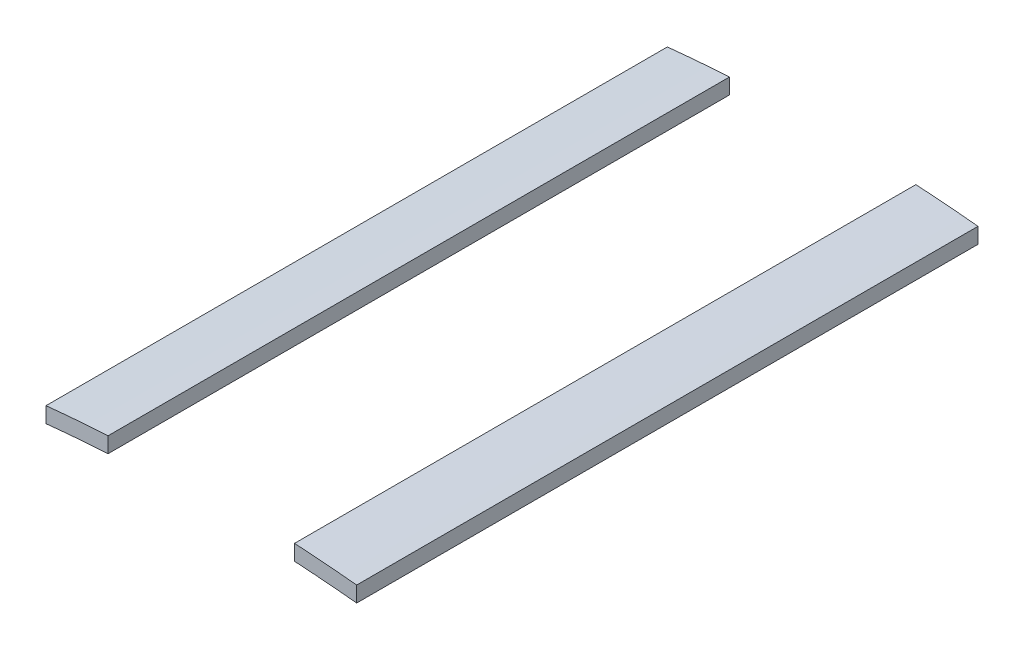
ISO-10303-21;
HEADER;
FILE_DESCRIPTION(('STEP AP214'),'2;1');
FILE_NAME('part.step','',(''),(''),'','','');
FILE_SCHEMA(('AUTOMOTIVE_DESIGN { 1 0 10303 214 1 1 1 1 }'));
ENDSEC;
DATA;
#1=APPLICATION_CONTEXT('core data for automotive mechanical design processes');
#2=APPLICATION_PROTOCOL_DEFINITION('international standard','automotive_design',2000,#1);
#3=PRODUCT_CONTEXT('',#1,'mechanical');
#4=PRODUCT('Part','Part','',(#3));
#5=PRODUCT_RELATED_PRODUCT_CATEGORY('part','',(#4));
#6=PRODUCT_DEFINITION_FORMATION('','',#4);
#7=PRODUCT_DEFINITION_CONTEXT('part definition',#1,'design');
#8=PRODUCT_DEFINITION('design','',#6,#7);
#9=PRODUCT_DEFINITION_SHAPE('','',#8);
#10=(LENGTH_UNIT() NAMED_UNIT(*) SI_UNIT(.MILLI.,.METRE.));
#11=(NAMED_UNIT(*) PLANE_ANGLE_UNIT() SI_UNIT($,.RADIAN.));
#12=(NAMED_UNIT(*) SI_UNIT($,.STERADIAN.) SOLID_ANGLE_UNIT());
#13=UNCERTAINTY_MEASURE_WITH_UNIT(LENGTH_MEASURE(1.E-05),#10,'distance_accuracy_value','');
#14=(GEOMETRIC_REPRESENTATION_CONTEXT(3) GLOBAL_UNCERTAINTY_ASSIGNED_CONTEXT((#13)) GLOBAL_UNIT_ASSIGNED_CONTEXT((#10,
#11,#12)) REPRESENTATION_CONTEXT('',''));
#15=CARTESIAN_POINT('',(0.,0.,0.));
#16=DIRECTION('',(0.,0.,1.));
#17=DIRECTION('',(1.,0.,0.));
#18=AXIS2_PLACEMENT_3D('',#15,#16,#17);
#19=CARTESIAN_POINT('',(0.,0.,20.));
#20=DIRECTION('',(0.,0.,-1.));
#21=DIRECTION('',(-1.,0.,0.));
#22=AXIS2_PLACEMENT_3D('',#19,#20,#21);
#23=CYLINDRICAL_SURFACE('',#22,49.5);
#24=CARTESIAN_POINT('',(0.,0.,0.));
#25=DIRECTION('',(0.,0.,1.));
#26=DIRECTION('',(1.,0.,0.));
#27=AXIS2_PLACEMENT_3D('',#24,#25,#26);
#28=CIRCLE('',#27,49.5);
#29=CARTESIAN_POINT('',(5.,49.246827308975,0.));
#30=VERTEX_POINT('',#29);
#31=CARTESIAN_POINT('',(3.,49.4090072760018,0.));
#32=VERTEX_POINT('',#31);
#33=EDGE_CURVE('E106',#30,#32,#28,.T.);
#34=ORIENTED_EDGE('',*,*,#33,.T.);
#35=DIRECTION('',(0.,0.,-1.));
#36=VECTOR('',#35,1.);
#37=CARTESIAN_POINT('',(3.,49.4090072760018,20.));
#38=LINE('',#37,#36);
#39=CARTESIAN_POINT('',(3.,49.4090072760018,20.));
#40=VERTEX_POINT('',#39);
#41=EDGE_CURVE('E12',#40,#32,#38,.T.);
#42=ORIENTED_EDGE('',*,*,#41,.F.);
#43=CARTESIAN_POINT('',(0.,0.,20.));
#44=DIRECTION('',(0.,0.,1.));
#45=DIRECTION('',(1.,0.,0.));
#46=AXIS2_PLACEMENT_3D('',#43,#44,#45);
#47=CIRCLE('',#46,49.5);
#48=CARTESIAN_POINT('',(5.,49.246827308975,20.));
#49=VERTEX_POINT('',#48);
#50=EDGE_CURVE('E94',#49,#40,#47,.T.);
#51=ORIENTED_EDGE('',*,*,#50,.F.);
#52=DIRECTION('',(0.,0.,-1.));
#53=VECTOR('',#52,1.);
#54=CARTESIAN_POINT('',(5.,49.246827308975,20.));
#55=LINE('',#54,#53);
#56=EDGE_CURVE('E102',#49,#30,#55,.T.);
#57=ORIENTED_EDGE('',*,*,#56,.T.);
#58=EDGE_LOOP('',(#34,#42,#51,#57));
#59=FACE_BOUND('',#58,.T.);
#60=ADVANCED_FACE('F43',(#59),#23,.T.);
#61=CARTESIAN_POINT('',(3.,49.4090072760018,20.));
#62=DIRECTION('',(1.,0.,0.));
#63=DIRECTION('',(0.,0.,-1.));
#64=AXIS2_PLACEMENT_3D('',#61,#62,#63);
#65=PLANE('',#64);
#66=DIRECTION('',(0.,-1.,0.));
#67=VECTOR('',#66,1.);
#68=CARTESIAN_POINT('',(3.,49.4090072760018,0.));
#69=LINE('',#68,#67);
#70=CARTESIAN_POINT('',(3.,48.9080770425499,0.));
#71=VERTEX_POINT('',#70);
#72=EDGE_CURVE('E98',#32,#71,#69,.T.);
#73=ORIENTED_EDGE('',*,*,#72,.T.);
#74=DIRECTION('',(0.,0.,-1.));
#75=VECTOR('',#74,1.);
#76=CARTESIAN_POINT('',(3.,48.9080770425499,20.));
#77=LINE('',#76,#75);
#78=CARTESIAN_POINT('',(3.,48.9080770425499,20.));
#79=VERTEX_POINT('',#78);
#80=EDGE_CURVE('E51',#79,#71,#77,.T.);
#81=ORIENTED_EDGE('',*,*,#80,.F.);
#82=DIRECTION('',(0.,-1.,0.));
#83=VECTOR('',#82,1.);
#84=CARTESIAN_POINT('',(3.,49.4090072760018,20.));
#85=LINE('',#84,#83);
#86=EDGE_CURVE('E89',#40,#79,#85,.T.);
#87=ORIENTED_EDGE('',*,*,#86,.F.);
#88=ORIENTED_EDGE('',*,*,#41,.T.);
#89=EDGE_LOOP('',(#73,#81,#87,#88));
#90=FACE_BOUND('',#89,.T.);
#91=ADVANCED_FACE('F97',(#90),#65,.F.);
#92=CARTESIAN_POINT('',(0.,0.,20.));
#93=DIRECTION('',(0.,0.,-1.));
#94=DIRECTION('',(-1.,0.,0.));
#95=AXIS2_PLACEMENT_3D('',#92,#93,#94);
#96=CYLINDRICAL_SURFACE('',#95,49.);
#97=CARTESIAN_POINT('',(0.,0.,0.));
#98=DIRECTION('',(0.,0.,-1.));
#99=DIRECTION('',(1.,0.,0.));
#100=AXIS2_PLACEMENT_3D('',#97,#98,#99);
#101=CIRCLE('',#100,49.);
#102=CARTESIAN_POINT('',(5.,48.7442304278158,0.));
#103=VERTEX_POINT('',#102);
#104=EDGE_CURVE('E76',#71,#103,#101,.T.);
#105=ORIENTED_EDGE('',*,*,#104,.T.);
#106=DIRECTION('',(0.,0.,-1.));
#107=VECTOR('',#106,1.);
#108=CARTESIAN_POINT('',(5.,48.7442304278158,20.));
#109=LINE('',#108,#107);
#110=CARTESIAN_POINT('',(5.,48.7442304278158,20.));
#111=VERTEX_POINT('',#110);
#112=EDGE_CURVE('E99',#111,#103,#109,.T.);
#113=ORIENTED_EDGE('',*,*,#112,.F.);
#114=CARTESIAN_POINT('',(0.,0.,20.));
#115=DIRECTION('',(0.,0.,-1.));
#116=DIRECTION('',(1.,0.,0.));
#117=AXIS2_PLACEMENT_3D('',#114,#115,#116);
#118=CIRCLE('',#117,49.);
#119=EDGE_CURVE('E92',#79,#111,#118,.T.);
#120=ORIENTED_EDGE('',*,*,#119,.F.);
#121=ORIENTED_EDGE('',*,*,#80,.T.);
#122=EDGE_LOOP('',(#105,#113,#120,#121));
#123=FACE_BOUND('',#122,.T.);
#124=ADVANCED_FACE('F100',(#123),#96,.F.);
#125=CARTESIAN_POINT('',(5.,49.246827308975,20.));
#126=DIRECTION('',(-1.,0.,0.));
#127=DIRECTION('',(0.,0.,1.));
#128=AXIS2_PLACEMENT_3D('',#125,#126,#127);
#129=PLANE('',#128);
#130=DIRECTION('',(0.,1.,0.));
#131=VECTOR('',#130,1.);
#132=CARTESIAN_POINT('',(5.,49.246827308975,0.));
#133=LINE('',#132,#131);
#134=EDGE_CURVE('E82',#103,#30,#133,.T.);
#135=ORIENTED_EDGE('',*,*,#134,.T.);
#136=ORIENTED_EDGE('',*,*,#56,.F.);
#137=DIRECTION('',(0.,1.,0.));
#138=VECTOR('',#137,1.);
#139=CARTESIAN_POINT('',(5.,49.246827308975,20.));
#140=LINE('',#139,#138);
#141=EDGE_CURVE('E59',#111,#49,#140,.T.);
#142=ORIENTED_EDGE('',*,*,#141,.F.);
#143=ORIENTED_EDGE('',*,*,#112,.T.);
#144=EDGE_LOOP('',(#135,#136,#142,#143));
#145=FACE_BOUND('',#144,.T.);
#146=ADVANCED_FACE('F113',(#145),#129,.F.);
#147=CARTESIAN_POINT('',(0.,0.,20.));
#148=DIRECTION('',(0.,0.,1.));
#149=DIRECTION('',(1.,0.,0.));
#150=AXIS2_PLACEMENT_3D('',#147,#148,#149);
#151=PLANE('',#150);
#152=ORIENTED_EDGE('',*,*,#50,.T.);
#153=ORIENTED_EDGE('',*,*,#86,.T.);
#154=ORIENTED_EDGE('',*,*,#119,.T.);
#155=ORIENTED_EDGE('',*,*,#141,.T.);
#156=EDGE_LOOP('',(#152,#153,#154,#155));
#157=FACE_BOUND('',#156,.T.);
#158=ADVANCED_FACE('F90',(#157),#151,.T.);
#159=CARTESIAN_POINT('',(0.,0.,0.));
#160=DIRECTION('',(0.,0.,1.));
#161=DIRECTION('',(1.,0.,0.));
#162=AXIS2_PLACEMENT_3D('',#159,#160,#161);
#163=PLANE('',#162);
#164=ORIENTED_EDGE('',*,*,#33,.F.);
#165=ORIENTED_EDGE('',*,*,#134,.F.);
#166=ORIENTED_EDGE('',*,*,#104,.F.);
#167=ORIENTED_EDGE('',*,*,#72,.F.);
#168=EDGE_LOOP('',(#164,#165,#166,#167));
#169=FACE_BOUND('',#168,.T.);
#170=ADVANCED_FACE('F116',(#169),#163,.F.);
#171=CLOSED_SHELL('',(#60,#91,#124,#146,#158,#170));
#172=MANIFOLD_SOLID_BREP('B2',#171);
#173=CARTESIAN_POINT('',(0.,0.,20.));
#174=DIRECTION('',(0.,0.,-1.));
#175=DIRECTION('',(-1.,0.,0.));
#176=AXIS2_PLACEMENT_3D('',#173,#174,#175);
#177=CYLINDRICAL_SURFACE('',#176,49.);
#178=CARTESIAN_POINT('',(0.,0.,0.));
#179=DIRECTION('',(0.,0.,-1.));
#180=DIRECTION('',(1.,0.,0.));
#181=AXIS2_PLACEMENT_3D('',#178,#179,#180);
#182=CIRCLE('',#181,49.);
#183=CARTESIAN_POINT('',(-4.99999999999999,48.7442304278158,0.));
#184=VERTEX_POINT('',#183);
#185=CARTESIAN_POINT('',(-3.,48.9080770425499,0.));
#186=VERTEX_POINT('',#185);
#187=EDGE_CURVE('E230',#184,#186,#182,.T.);
#188=ORIENTED_EDGE('',*,*,#187,.T.);
#189=DIRECTION('',(0.,0.,-1.));
#190=VECTOR('',#189,1.);
#191=CARTESIAN_POINT('',(-3.,48.9080770425499,20.));
#192=LINE('',#191,#190);
#193=CARTESIAN_POINT('',(-3.,48.9080770425499,20.));
#194=VERTEX_POINT('',#193);
#195=EDGE_CURVE('E41',#194,#186,#192,.T.);
#196=ORIENTED_EDGE('',*,*,#195,.F.);
#197=CARTESIAN_POINT('',(0.,0.,20.));
#198=DIRECTION('',(0.,0.,-1.));
#199=DIRECTION('',(1.,0.,0.));
#200=AXIS2_PLACEMENT_3D('',#197,#198,#199);
#201=CIRCLE('',#200,49.);
#202=CARTESIAN_POINT('',(-4.99999999999999,48.7442304278158,20.));
#203=VERTEX_POINT('',#202);
#204=EDGE_CURVE('E218',#203,#194,#201,.T.);
#205=ORIENTED_EDGE('',*,*,#204,.F.);
#206=DIRECTION('',(0.,0.,-1.));
#207=VECTOR('',#206,1.);
#208=CARTESIAN_POINT('',(-4.99999999999999,48.7442304278158,20.));
#209=LINE('',#208,#207);
#210=EDGE_CURVE('E226',#203,#184,#209,.T.);
#211=ORIENTED_EDGE('',*,*,#210,.T.);
#212=EDGE_LOOP('',(#188,#196,#205,#211));
#213=FACE_BOUND('',#212,.T.);
#214=ADVANCED_FACE('F167',(#213),#177,.F.);
#215=CARTESIAN_POINT('',(-3.,49.4090072760018,20.));
#216=DIRECTION('',(-1.,0.,0.));
#217=DIRECTION('',(0.,0.,1.));
#218=AXIS2_PLACEMENT_3D('',#215,#216,#217);
#219=PLANE('',#218);
#220=DIRECTION('',(0.,1.,0.));
#221=VECTOR('',#220,1.);
#222=CARTESIAN_POINT('',(-3.,49.4090072760018,0.));
#223=LINE('',#222,#221);
#224=CARTESIAN_POINT('',(-3.,49.4090072760018,0.));
#225=VERTEX_POINT('',#224);
#226=EDGE_CURVE('E222',#186,#225,#223,.T.);
#227=ORIENTED_EDGE('',*,*,#226,.T.);
#228=DIRECTION('',(0.,0.,-1.));
#229=VECTOR('',#228,1.);
#230=CARTESIAN_POINT('',(-3.,49.4090072760018,20.));
#231=LINE('',#230,#229);
#232=CARTESIAN_POINT('',(-3.,49.4090072760018,20.));
#233=VERTEX_POINT('',#232);
#234=EDGE_CURVE('E175',#233,#225,#231,.T.);
#235=ORIENTED_EDGE('',*,*,#234,.F.);
#236=DIRECTION('',(0.,1.,0.));
#237=VECTOR('',#236,1.);
#238=CARTESIAN_POINT('',(-3.,49.4090072760018,20.));
#239=LINE('',#238,#237);
#240=EDGE_CURVE('E213',#194,#233,#239,.T.);
#241=ORIENTED_EDGE('',*,*,#240,.F.);
#242=ORIENTED_EDGE('',*,*,#195,.T.);
#243=EDGE_LOOP('',(#227,#235,#241,#242));
#244=FACE_BOUND('',#243,.T.);
#245=ADVANCED_FACE('F221',(#244),#219,.F.);
#246=CARTESIAN_POINT('',(0.,0.,20.));
#247=DIRECTION('',(0.,0.,-1.));
#248=DIRECTION('',(-1.,0.,0.));
#249=AXIS2_PLACEMENT_3D('',#246,#247,#248);
#250=CYLINDRICAL_SURFACE('',#249,49.5);
#251=CARTESIAN_POINT('',(0.,0.,0.));
#252=DIRECTION('',(0.,0.,1.));
#253=DIRECTION('',(1.,0.,0.));
#254=AXIS2_PLACEMENT_3D('',#251,#252,#253);
#255=CIRCLE('',#254,49.5);
#256=CARTESIAN_POINT('',(-4.99999999999999,49.246827308975,0.));
#257=VERTEX_POINT('',#256);
#258=EDGE_CURVE('E200',#225,#257,#255,.T.);
#259=ORIENTED_EDGE('',*,*,#258,.T.);
#260=DIRECTION('',(0.,0.,-1.));
#261=VECTOR('',#260,1.);
#262=CARTESIAN_POINT('',(-4.99999999999999,49.246827308975,20.));
#263=LINE('',#262,#261);
#264=CARTESIAN_POINT('',(-4.99999999999999,49.246827308975,20.));
#265=VERTEX_POINT('',#264);
#266=EDGE_CURVE('E223',#265,#257,#263,.T.);
#267=ORIENTED_EDGE('',*,*,#266,.F.);
#268=CARTESIAN_POINT('',(0.,0.,20.));
#269=DIRECTION('',(0.,0.,1.));
#270=DIRECTION('',(1.,0.,0.));
#271=AXIS2_PLACEMENT_3D('',#268,#269,#270);
#272=CIRCLE('',#271,49.5);
#273=EDGE_CURVE('E216',#233,#265,#272,.T.);
#274=ORIENTED_EDGE('',*,*,#273,.F.);
#275=ORIENTED_EDGE('',*,*,#234,.T.);
#276=EDGE_LOOP('',(#259,#267,#274,#275));
#277=FACE_BOUND('',#276,.T.);
#278=ADVANCED_FACE('F224',(#277),#250,.T.);
#279=CARTESIAN_POINT('',(-4.99999999999999,49.246827308975,20.));
#280=DIRECTION('',(1.,0.,0.));
#281=DIRECTION('',(0.,0.,-1.));
#282=AXIS2_PLACEMENT_3D('',#279,#280,#281);
#283=PLANE('',#282);
#284=DIRECTION('',(0.,-1.,0.));
#285=VECTOR('',#284,1.);
#286=CARTESIAN_POINT('',(-4.99999999999999,49.246827308975,0.));
#287=LINE('',#286,#285);
#288=EDGE_CURVE('E206',#257,#184,#287,.T.);
#289=ORIENTED_EDGE('',*,*,#288,.T.);
#290=ORIENTED_EDGE('',*,*,#210,.F.);
#291=DIRECTION('',(0.,-1.,0.));
#292=VECTOR('',#291,1.);
#293=CARTESIAN_POINT('',(-4.99999999999999,49.246827308975,20.));
#294=LINE('',#293,#292);
#295=EDGE_CURVE('E183',#265,#203,#294,.T.);
#296=ORIENTED_EDGE('',*,*,#295,.F.);
#297=ORIENTED_EDGE('',*,*,#266,.T.);
#298=EDGE_LOOP('',(#289,#290,#296,#297));
#299=FACE_BOUND('',#298,.T.);
#300=ADVANCED_FACE('F237',(#299),#283,.F.);
#301=CARTESIAN_POINT('',(0.,0.,20.));
#302=DIRECTION('',(0.,0.,1.));
#303=DIRECTION('',(1.,0.,0.));
#304=AXIS2_PLACEMENT_3D('',#301,#302,#303);
#305=PLANE('',#304);
#306=ORIENTED_EDGE('',*,*,#204,.T.);
#307=ORIENTED_EDGE('',*,*,#240,.T.);
#308=ORIENTED_EDGE('',*,*,#273,.T.);
#309=ORIENTED_EDGE('',*,*,#295,.T.);
#310=EDGE_LOOP('',(#306,#307,#308,#309));
#311=FACE_BOUND('',#310,.T.);
#312=ADVANCED_FACE('F214',(#311),#305,.T.);
#313=CARTESIAN_POINT('',(0.,0.,0.));
#314=DIRECTION('',(0.,0.,1.));
#315=DIRECTION('',(1.,0.,0.));
#316=AXIS2_PLACEMENT_3D('',#313,#314,#315);
#317=PLANE('',#316);
#318=ORIENTED_EDGE('',*,*,#187,.F.);
#319=ORIENTED_EDGE('',*,*,#288,.F.);
#320=ORIENTED_EDGE('',*,*,#258,.F.);
#321=ORIENTED_EDGE('',*,*,#226,.F.);
#322=EDGE_LOOP('',(#318,#319,#320,#321));
#323=FACE_BOUND('',#322,.T.);
#324=ADVANCED_FACE('F240',(#323),#317,.F.);
#325=CLOSED_SHELL('',(#214,#245,#278,#300,#312,#324));
#326=MANIFOLD_SOLID_BREP('B6',#325);
#327=ADVANCED_BREP_SHAPE_REPRESENTATION('',(#18,#172,#326),#14);
#328=SHAPE_DEFINITION_REPRESENTATION(#9,#327);
ENDSEC;
END-ISO-10303-21;
